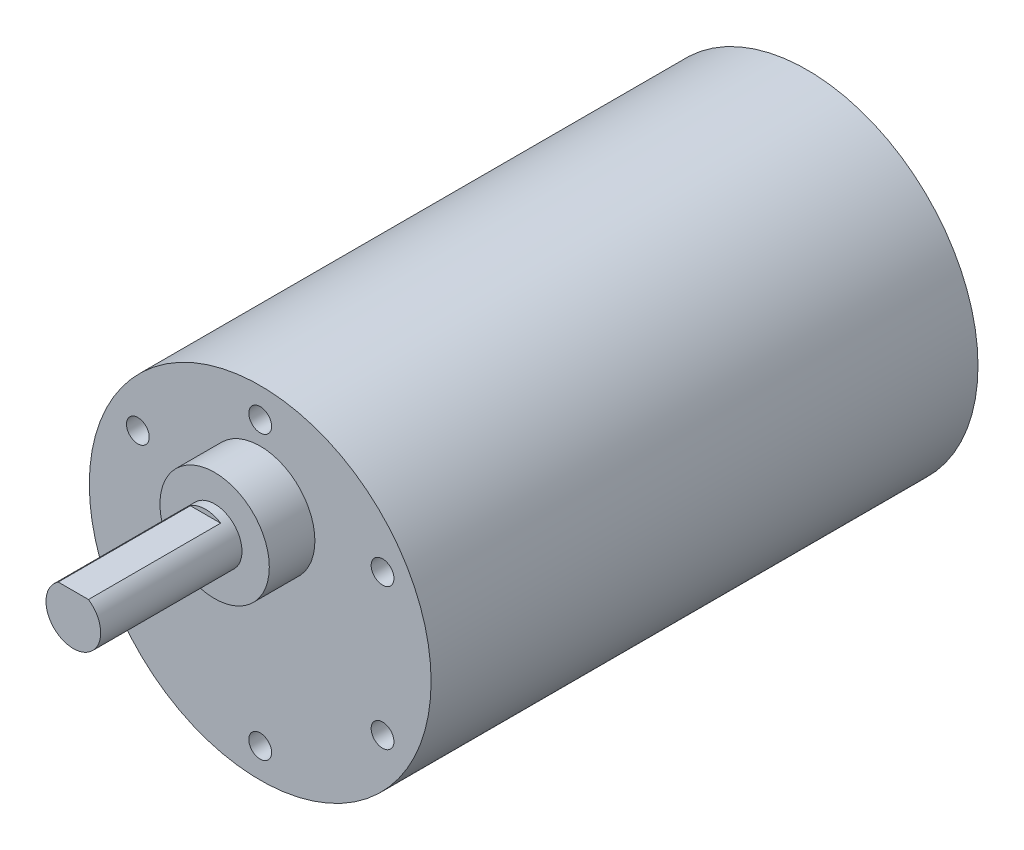
ISO-10303-21;
HEADER;
FILE_DESCRIPTION(('STEP AP214'),'2;1');
FILE_NAME('part.step','',(''),(''),'','','');
FILE_SCHEMA(('AUTOMOTIVE_DESIGN { 1 0 10303 214 1 1 1 1 }'));
ENDSEC;
DATA;
#1=APPLICATION_CONTEXT('core data for automotive mechanical design processes');
#2=APPLICATION_PROTOCOL_DEFINITION('international standard','automotive_design',2000,#1);
#3=PRODUCT_CONTEXT('',#1,'mechanical');
#4=PRODUCT('Part','Part','',(#3));
#5=PRODUCT_RELATED_PRODUCT_CATEGORY('part','',(#4));
#6=PRODUCT_DEFINITION_FORMATION('','',#4);
#7=PRODUCT_DEFINITION_CONTEXT('part definition',#1,'design');
#8=PRODUCT_DEFINITION('design','',#6,#7);
#9=PRODUCT_DEFINITION_SHAPE('','',#8);
#10=(LENGTH_UNIT() NAMED_UNIT(*) SI_UNIT(.MILLI.,.METRE.));
#11=(NAMED_UNIT(*) PLANE_ANGLE_UNIT() SI_UNIT($,.RADIAN.));
#12=(NAMED_UNIT(*) SI_UNIT($,.STERADIAN.) SOLID_ANGLE_UNIT());
#13=UNCERTAINTY_MEASURE_WITH_UNIT(LENGTH_MEASURE(1.E-05),#10,'distance_accuracy_value','');
#14=(GEOMETRIC_REPRESENTATION_CONTEXT(3) GLOBAL_UNCERTAINTY_ASSIGNED_CONTEXT((#13)) GLOBAL_UNIT_ASSIGNED_CONTEXT((#10,
#11,#12)) REPRESENTATION_CONTEXT('',''));
#15=CARTESIAN_POINT('',(0.,0.,0.));
#16=DIRECTION('',(0.,0.,1.));
#17=DIRECTION('',(1.,0.,0.));
#18=AXIS2_PLACEMENT_3D('',#15,#16,#17);
#19=CARTESIAN_POINT('',(0.,0.,60.));
#20=DIRECTION('',(0.,0.,-1.));
#21=DIRECTION('',(-1.,0.,0.));
#22=AXIS2_PLACEMENT_3D('',#19,#20,#21);
#23=CYLINDRICAL_SURFACE('',#22,18.75);
#24=CARTESIAN_POINT('',(0.,0.,60.));
#25=DIRECTION('',(0.,0.,1.));
#26=DIRECTION('',(1.,0.,0.));
#27=AXIS2_PLACEMENT_3D('',#24,#25,#26);
#28=CIRCLE('',#27,18.75);
#29=CARTESIAN_POINT('',(18.75,0.,60.));
#30=VERTEX_POINT('',#29);
#31=EDGE_CURVE('E142',#30,#30,#28,.T.);
#32=ORIENTED_EDGE('',*,*,#31,.F.);
#33=EDGE_LOOP('',(#32));
#34=FACE_BOUND('',#33,.T.);
#35=CARTESIAN_POINT('',(0.,0.,0.));
#36=DIRECTION('',(0.,0.,1.));
#37=DIRECTION('',(1.,0.,0.));
#38=AXIS2_PLACEMENT_3D('',#35,#36,#37);
#39=CIRCLE('',#38,18.75);
#40=CARTESIAN_POINT('',(18.75,0.,0.));
#41=VERTEX_POINT('',#40);
#42=EDGE_CURVE('E146',#41,#41,#39,.T.);
#43=ORIENTED_EDGE('',*,*,#42,.T.);
#44=EDGE_LOOP('',(#43));
#45=FACE_BOUND('',#44,.T.);
#46=ADVANCED_FACE('F43',(#34,#45),#23,.T.);
#47=CARTESIAN_POINT('',(0.,0.,60.));
#48=DIRECTION('',(0.,0.,1.));
#49=DIRECTION('',(1.,0.,0.));
#50=AXIS2_PLACEMENT_3D('',#47,#48,#49);
#51=PLANE('',#50);
#52=CARTESIAN_POINT('',(-13.4233937586587,7.75000000000016,60.));
#53=DIRECTION('',(0.,0.,1.));
#54=DIRECTION('',(1.,0.,0.));
#55=AXIS2_PLACEMENT_3D('',#52,#53,#54);
#56=CIRCLE('',#55,1.24999999999999);
#57=CARTESIAN_POINT('',(-12.1733937586587,7.75000000000016,60.));
#58=VERTEX_POINT('',#57);
#59=EDGE_CURVE('E97',#58,#58,#56,.T.);
#60=ORIENTED_EDGE('',*,*,#59,.F.);
#61=EDGE_LOOP('',(#60));
#62=FACE_BOUND('',#61,.T.);
#63=CARTESIAN_POINT('',(-13.4233937586589,-7.74999999999987,60.));
#64=DIRECTION('',(0.,0.,1.));
#65=DIRECTION('',(1.,0.,0.));
#66=AXIS2_PLACEMENT_3D('',#63,#64,#65);
#67=CIRCLE('',#66,1.24999999999999);
#68=CARTESIAN_POINT('',(-12.1733937586589,-7.74999999999987,60.));
#69=VERTEX_POINT('',#68);
#70=EDGE_CURVE('E96',#69,#69,#67,.T.);
#71=ORIENTED_EDGE('',*,*,#70,.F.);
#72=EDGE_LOOP('',(#71));
#73=FACE_BOUND('',#72,.T.);
#74=CARTESIAN_POINT('',(0.,-15.5,60.));
#75=DIRECTION('',(0.,0.,1.));
#76=DIRECTION('',(1.,0.,0.));
#77=AXIS2_PLACEMENT_3D('',#74,#75,#76);
#78=CIRCLE('',#77,1.24999999999999);
#79=CARTESIAN_POINT('',(1.24999999999999,-15.5,60.));
#80=VERTEX_POINT('',#79);
#81=EDGE_CURVE('E107',#80,#80,#78,.T.);
#82=ORIENTED_EDGE('',*,*,#81,.F.);
#83=EDGE_LOOP('',(#82));
#84=FACE_BOUND('',#83,.T.);
#85=CARTESIAN_POINT('',(13.4233937586588,-7.75000000000006,60.));
#86=DIRECTION('',(0.,0.,1.));
#87=DIRECTION('',(1.,0.,0.));
#88=AXIS2_PLACEMENT_3D('',#85,#86,#87);
#89=CIRCLE('',#88,1.24999999999999);
#90=CARTESIAN_POINT('',(14.6733937586588,-7.75000000000006,60.));
#91=VERTEX_POINT('',#90);
#92=EDGE_CURVE('E113',#91,#91,#89,.T.);
#93=ORIENTED_EDGE('',*,*,#92,.F.);
#94=EDGE_LOOP('',(#93));
#95=FACE_BOUND('',#94,.T.);
#96=CARTESIAN_POINT('',(13.4233937586588,7.74999999999997,60.));
#97=DIRECTION('',(0.,0.,1.));
#98=DIRECTION('',(1.,0.,0.));
#99=AXIS2_PLACEMENT_3D('',#96,#97,#98);
#100=CIRCLE('',#99,1.24999999999999);
#101=CARTESIAN_POINT('',(14.6733937586588,7.74999999999997,60.));
#102=VERTEX_POINT('',#101);
#103=EDGE_CURVE('E119',#102,#102,#100,.T.);
#104=ORIENTED_EDGE('',*,*,#103,.F.);
#105=EDGE_LOOP('',(#104));
#106=FACE_BOUND('',#105,.T.);
#107=CARTESIAN_POINT('',(0.,15.5,60.));
#108=DIRECTION('',(0.,0.,1.));
#109=DIRECTION('',(1.,0.,0.));
#110=AXIS2_PLACEMENT_3D('',#107,#108,#109);
#111=CIRCLE('',#110,1.24999999999999);
#112=CARTESIAN_POINT('',(1.24999999999999,15.5,60.));
#113=VERTEX_POINT('',#112);
#114=EDGE_CURVE('E125',#113,#113,#111,.T.);
#115=ORIENTED_EDGE('',*,*,#114,.F.);
#116=EDGE_LOOP('',(#115));
#117=FACE_BOUND('',#116,.T.);
#118=CARTESIAN_POINT('',(0.,7.,60.));
#119=DIRECTION('',(0.,0.,1.));
#120=DIRECTION('',(1.,0.,0.));
#121=AXIS2_PLACEMENT_3D('',#118,#119,#120);
#122=CIRCLE('',#121,6.);
#123=CARTESIAN_POINT('',(6.,7.,60.));
#124=VERTEX_POINT('',#123);
#125=EDGE_CURVE('E138',#124,#124,#122,.T.);
#126=ORIENTED_EDGE('',*,*,#125,.F.);
#127=EDGE_LOOP('',(#126));
#128=FACE_BOUND('',#127,.T.);
#129=ORIENTED_EDGE('',*,*,#31,.T.);
#130=EDGE_LOOP('',(#129));
#131=FACE_BOUND('',#130,.T.);
#132=ADVANCED_FACE('F173',(#62,#73,#84,#95,#106,#117,#128,#131),#51,.T.);
#133=CARTESIAN_POINT('',(0.,0.,0.));
#134=DIRECTION('',(0.,0.,1.));
#135=DIRECTION('',(1.,0.,0.));
#136=AXIS2_PLACEMENT_3D('',#133,#134,#135);
#137=PLANE('',#136);
#138=ORIENTED_EDGE('',*,*,#42,.F.);
#139=EDGE_LOOP('',(#138));
#140=FACE_BOUND('',#139,.T.);
#141=ADVANCED_FACE('F178',(#140),#137,.F.);
#142=CARTESIAN_POINT('',(0.,7.,65.));
#143=DIRECTION('',(0.,0.,-1.));
#144=DIRECTION('',(-1.,0.,0.));
#145=AXIS2_PLACEMENT_3D('',#142,#143,#144);
#146=CYLINDRICAL_SURFACE('',#145,6.);
#147=CARTESIAN_POINT('',(0.,7.,65.));
#148=DIRECTION('',(0.,0.,1.));
#149=DIRECTION('',(1.,0.,0.));
#150=AXIS2_PLACEMENT_3D('',#147,#148,#149);
#151=CIRCLE('',#150,6.);
#152=CARTESIAN_POINT('',(6.,7.,65.));
#153=VERTEX_POINT('',#152);
#154=EDGE_CURVE('E143',#153,#153,#151,.T.);
#155=ORIENTED_EDGE('',*,*,#154,.F.);
#156=EDGE_LOOP('',(#155));
#157=FACE_BOUND('',#156,.T.);
#158=ORIENTED_EDGE('',*,*,#125,.T.);
#159=EDGE_LOOP('',(#158));
#160=FACE_BOUND('',#159,.T.);
#161=ADVANCED_FACE('F186',(#157,#160),#146,.T.);
#162=CARTESIAN_POINT('',(0.,7.,65.));
#163=DIRECTION('',(0.,0.,1.));
#164=DIRECTION('',(1.,0.,0.));
#165=AXIS2_PLACEMENT_3D('',#162,#163,#164);
#166=PLANE('',#165);
#167=CARTESIAN_POINT('',(0.,7.,65.));
#168=DIRECTION('',(0.,0.,1.));
#169=DIRECTION('',(1.,0.,0.));
#170=AXIS2_PLACEMENT_3D('',#167,#168,#169);
#171=CIRCLE('',#170,3.);
#172=CARTESIAN_POINT('',(3.,7.,65.));
#173=VERTEX_POINT('',#172);
#174=EDGE_CURVE('E139',#173,#173,#171,.T.);
#175=ORIENTED_EDGE('',*,*,#174,.F.);
#176=EDGE_LOOP('',(#175));
#177=FACE_BOUND('',#176,.T.);
#178=ORIENTED_EDGE('',*,*,#154,.T.);
#179=EDGE_LOOP('',(#178));
#180=FACE_BOUND('',#179,.T.);
#181=ADVANCED_FACE('F169',(#177,#180),#166,.T.);
#182=CARTESIAN_POINT('',(0.,7.,80.5));
#183=DIRECTION('',(0.,0.,-1.));
#184=DIRECTION('',(-1.,0.,0.));
#185=AXIS2_PLACEMENT_3D('',#182,#183,#184);
#186=CYLINDRICAL_SURFACE('',#185,3.);
#187=CARTESIAN_POINT('',(0.,7.,80.5));
#188=DIRECTION('',(0.,0.,1.));
#189=DIRECTION('',(1.,0.,0.));
#190=AXIS2_PLACEMENT_3D('',#187,#188,#189);
#191=CIRCLE('',#190,3.);
#192=CARTESIAN_POINT('',(-1.6583123951777,9.5,80.5));
#193=VERTEX_POINT('',#192);
#194=CARTESIAN_POINT('',(1.6583123951777,9.5,80.5));
#195=VERTEX_POINT('',#194);
#196=EDGE_CURVE('E135',#193,#195,#191,.T.);
#197=ORIENTED_EDGE('',*,*,#196,.F.);
#198=DIRECTION('',(0.,0.,-1.));
#199=VECTOR('',#198,1.);
#200=CARTESIAN_POINT('',(-1.6583123951777,9.5,80.5));
#201=LINE('',#200,#199);
#202=CARTESIAN_POINT('',(-1.6583123951777,9.5,66.));
#203=VERTEX_POINT('',#202);
#204=EDGE_CURVE('E57',#193,#203,#201,.T.);
#205=ORIENTED_EDGE('',*,*,#204,.T.);
#206=CARTESIAN_POINT('',(0.,7.,66.));
#207=DIRECTION('',(0.,0.,1.));
#208=DIRECTION('',(1.,0.,0.));
#209=AXIS2_PLACEMENT_3D('',#206,#207,#208);
#210=CIRCLE('',#209,3.);
#211=CARTESIAN_POINT('',(1.6583123951777,9.5,66.));
#212=VERTEX_POINT('',#211);
#213=EDGE_CURVE('E11',#212,#203,#210,.T.);
#214=ORIENTED_EDGE('',*,*,#213,.F.);
#215=DIRECTION('',(0.,0.,-1.));
#216=VECTOR('',#215,1.);
#217=CARTESIAN_POINT('',(1.6583123951777,9.5,80.5));
#218=LINE('',#217,#216);
#219=EDGE_CURVE('E62',#212,#195,#218,.F.);
#220=ORIENTED_EDGE('',*,*,#219,.T.);
#221=EDGE_LOOP('',(#197,#205,#214,#220));
#222=FACE_BOUND('',#221,.T.);
#223=ORIENTED_EDGE('',*,*,#174,.T.);
#224=EDGE_LOOP('',(#223));
#225=FACE_BOUND('',#224,.T.);
#226=ADVANCED_FACE('F157',(#222,#225),#186,.T.);
#227=CARTESIAN_POINT('',(0.,7.,80.5));
#228=DIRECTION('',(0.,0.,1.));
#229=DIRECTION('',(1.,0.,0.));
#230=AXIS2_PLACEMENT_3D('',#227,#228,#229);
#231=PLANE('',#230);
#232=DIRECTION('',(1.,0.,0.));
#233=VECTOR('',#232,1.);
#234=CARTESIAN_POINT('',(0.,9.5,80.5));
#235=LINE('',#234,#233);
#236=EDGE_CURVE('E50',#193,#195,#235,.T.);
#237=ORIENTED_EDGE('',*,*,#236,.F.);
#238=ORIENTED_EDGE('',*,*,#196,.T.);
#239=EDGE_LOOP('',(#237,#238));
#240=FACE_BOUND('',#239,.T.);
#241=ADVANCED_FACE('F159',(#240),#231,.T.);
#242=CARTESIAN_POINT('',(0.,0.,66.));
#243=DIRECTION('',(0.,0.,1.));
#244=DIRECTION('',(1.,0.,0.));
#245=AXIS2_PLACEMENT_3D('',#242,#243,#244);
#246=PLANE('',#245);
#247=ORIENTED_EDGE('',*,*,#213,.T.);
#248=DIRECTION('',(1.,0.,0.));
#249=VECTOR('',#248,1.);
#250=CARTESIAN_POINT('',(-3.70795386806472,9.5,66.));
#251=LINE('',#250,#249);
#252=EDGE_CURVE('E131',#203,#212,#251,.T.);
#253=ORIENTED_EDGE('',*,*,#252,.T.);
#254=EDGE_LOOP('',(#247,#253));
#255=FACE_BOUND('',#254,.T.);
#256=ADVANCED_FACE('F161',(#255),#246,.T.);
#257=CARTESIAN_POINT('',(-3.70795386806472,9.5,66.));
#258=DIRECTION('',(0.,-1.,0.));
#259=DIRECTION('',(0.,0.,-1.));
#260=AXIS2_PLACEMENT_3D('',#257,#258,#259);
#261=PLANE('',#260);
#262=ORIENTED_EDGE('',*,*,#236,.T.);
#263=ORIENTED_EDGE('',*,*,#219,.F.);
#264=ORIENTED_EDGE('',*,*,#252,.F.);
#265=ORIENTED_EDGE('',*,*,#204,.F.);
#266=EDGE_LOOP('',(#262,#263,#264,#265));
#267=FACE_BOUND('',#266,.T.);
#268=ADVANCED_FACE('F152',(#267),#261,.F.);
#269=CARTESIAN_POINT('',(0.,15.5,52.5));
#270=DIRECTION('',(0.,0.,1.));
#271=DIRECTION('',(1.,0.,0.));
#272=AXIS2_PLACEMENT_3D('',#269,#270,#271);
#273=CONICAL_SURFACE('',#272,1.24999999999999,1.02974425867665);
#274=CARTESIAN_POINT('',(0.,15.5,51.7489242262155));
#275=VERTEX_POINT('',#274);
#276=VERTEX_LOOP('',#275);
#277=FACE_BOUND('',#276,.T.);
#278=CARTESIAN_POINT('',(0.,15.5,52.5));
#279=DIRECTION('',(0.,0.,1.));
#280=DIRECTION('',(1.,0.,0.));
#281=AXIS2_PLACEMENT_3D('',#278,#279,#280);
#282=CIRCLE('',#281,1.24999999999999);
#283=CARTESIAN_POINT('',(1.24999999999999,15.5,52.5));
#284=VERTEX_POINT('',#283);
#285=EDGE_CURVE('E128',#284,#284,#282,.T.);
#286=ORIENTED_EDGE('',*,*,#285,.T.);
#287=EDGE_LOOP('',(#286));
#288=FACE_BOUND('',#287,.T.);
#289=ADVANCED_FACE('F229',(#277,#288),#273,.F.);
#290=CARTESIAN_POINT('',(0.,15.5,60.));
#291=DIRECTION('',(0.,0.,1.));
#292=DIRECTION('',(1.,0.,0.));
#293=AXIS2_PLACEMENT_3D('',#290,#291,#292);
#294=CYLINDRICAL_SURFACE('',#293,1.24999999999999);
#295=ORIENTED_EDGE('',*,*,#285,.F.);
#296=EDGE_LOOP('',(#295));
#297=FACE_BOUND('',#296,.T.);
#298=ORIENTED_EDGE('',*,*,#114,.T.);
#299=EDGE_LOOP('',(#298));
#300=FACE_BOUND('',#299,.T.);
#301=ADVANCED_FACE('F237',(#297,#300),#294,.F.);
#302=CARTESIAN_POINT('',(13.4233937586588,7.74999999999997,52.5));
#303=DIRECTION('',(0.,0.,1.));
#304=DIRECTION('',(1.,0.,0.));
#305=AXIS2_PLACEMENT_3D('',#302,#303,#304);
#306=CONICAL_SURFACE('',#305,1.24999999999999,1.02974425867665);
#307=CARTESIAN_POINT('',(13.4233937586588,7.74999999999997,51.7489242262155));
#308=VERTEX_POINT('',#307);
#309=VERTEX_LOOP('',#308);
#310=FACE_BOUND('',#309,.T.);
#311=CARTESIAN_POINT('',(13.4233937586588,7.74999999999997,52.5));
#312=DIRECTION('',(0.,0.,1.));
#313=DIRECTION('',(1.,0.,0.));
#314=AXIS2_PLACEMENT_3D('',#311,#312,#313);
#315=CIRCLE('',#314,1.24999999999999);
#316=CARTESIAN_POINT('',(14.6733937586588,7.74999999999997,52.5));
#317=VERTEX_POINT('',#316);
#318=EDGE_CURVE('E122',#317,#317,#315,.T.);
#319=ORIENTED_EDGE('',*,*,#318,.T.);
#320=EDGE_LOOP('',(#319));
#321=FACE_BOUND('',#320,.T.);
#322=ADVANCED_FACE('F248',(#310,#321),#306,.F.);
#323=CARTESIAN_POINT('',(13.4233937586588,7.74999999999997,60.));
#324=DIRECTION('',(0.,0.,1.));
#325=DIRECTION('',(1.,0.,0.));
#326=AXIS2_PLACEMENT_3D('',#323,#324,#325);
#327=CYLINDRICAL_SURFACE('',#326,1.24999999999999);
#328=ORIENTED_EDGE('',*,*,#318,.F.);
#329=EDGE_LOOP('',(#328));
#330=FACE_BOUND('',#329,.T.);
#331=ORIENTED_EDGE('',*,*,#103,.T.);
#332=EDGE_LOOP('',(#331));
#333=FACE_BOUND('',#332,.T.);
#334=ADVANCED_FACE('F268',(#330,#333),#327,.F.);
#335=CARTESIAN_POINT('',(13.4233937586588,-7.75000000000006,52.5));
#336=DIRECTION('',(0.,0.,1.));
#337=DIRECTION('',(1.,0.,0.));
#338=AXIS2_PLACEMENT_3D('',#335,#336,#337);
#339=CONICAL_SURFACE('',#338,1.24999999999999,1.02974425867665);
#340=CARTESIAN_POINT('',(13.4233937586588,-7.75000000000006,51.7489242262155));
#341=VERTEX_POINT('',#340);
#342=VERTEX_LOOP('',#341);
#343=FACE_BOUND('',#342,.T.);
#344=CARTESIAN_POINT('',(13.4233937586588,-7.75000000000006,52.5));
#345=DIRECTION('',(0.,0.,1.));
#346=DIRECTION('',(1.,0.,0.));
#347=AXIS2_PLACEMENT_3D('',#344,#345,#346);
#348=CIRCLE('',#347,1.24999999999999);
#349=CARTESIAN_POINT('',(14.6733937586588,-7.75000000000006,52.5));
#350=VERTEX_POINT('',#349);
#351=EDGE_CURVE('E116',#350,#350,#348,.T.);
#352=ORIENTED_EDGE('',*,*,#351,.T.);
#353=EDGE_LOOP('',(#352));
#354=FACE_BOUND('',#353,.T.);
#355=ADVANCED_FACE('F279',(#343,#354),#339,.F.);
#356=CARTESIAN_POINT('',(13.4233937586588,-7.75000000000006,60.));
#357=DIRECTION('',(0.,0.,1.));
#358=DIRECTION('',(1.,0.,0.));
#359=AXIS2_PLACEMENT_3D('',#356,#357,#358);
#360=CYLINDRICAL_SURFACE('',#359,1.24999999999999);
#361=ORIENTED_EDGE('',*,*,#351,.F.);
#362=EDGE_LOOP('',(#361));
#363=FACE_BOUND('',#362,.T.);
#364=ORIENTED_EDGE('',*,*,#92,.T.);
#365=EDGE_LOOP('',(#364));
#366=FACE_BOUND('',#365,.T.);
#367=ADVANCED_FACE('F292',(#363,#366),#360,.F.);
#368=CARTESIAN_POINT('',(0.,-15.5,52.5));
#369=DIRECTION('',(0.,0.,1.));
#370=DIRECTION('',(1.,0.,0.));
#371=AXIS2_PLACEMENT_3D('',#368,#369,#370);
#372=CONICAL_SURFACE('',#371,1.24999999999999,1.02974425867665);
#373=CARTESIAN_POINT('',(0.,-15.5,51.7489242262155));
#374=VERTEX_POINT('',#373);
#375=VERTEX_LOOP('',#374);
#376=FACE_BOUND('',#375,.T.);
#377=CARTESIAN_POINT('',(0.,-15.5,52.5));
#378=DIRECTION('',(0.,0.,1.));
#379=DIRECTION('',(1.,0.,0.));
#380=AXIS2_PLACEMENT_3D('',#377,#378,#379);
#381=CIRCLE('',#380,1.24999999999999);
#382=CARTESIAN_POINT('',(1.24999999999999,-15.5,52.5));
#383=VERTEX_POINT('',#382);
#384=EDGE_CURVE('E110',#383,#383,#381,.T.);
#385=ORIENTED_EDGE('',*,*,#384,.T.);
#386=EDGE_LOOP('',(#385));
#387=FACE_BOUND('',#386,.T.);
#388=ADVANCED_FACE('F302',(#376,#387),#372,.F.);
#389=CARTESIAN_POINT('',(0.,-15.5,60.));
#390=DIRECTION('',(0.,0.,1.));
#391=DIRECTION('',(1.,0.,0.));
#392=AXIS2_PLACEMENT_3D('',#389,#390,#391);
#393=CYLINDRICAL_SURFACE('',#392,1.24999999999999);
#394=ORIENTED_EDGE('',*,*,#384,.F.);
#395=EDGE_LOOP('',(#394));
#396=FACE_BOUND('',#395,.T.);
#397=ORIENTED_EDGE('',*,*,#81,.T.);
#398=EDGE_LOOP('',(#397));
#399=FACE_BOUND('',#398,.T.);
#400=ADVANCED_FACE('F314',(#396,#399),#393,.F.);
#401=CARTESIAN_POINT('',(-13.4233937586589,-7.74999999999987,52.5));
#402=DIRECTION('',(0.,0.,1.));
#403=DIRECTION('',(1.,0.,0.));
#404=AXIS2_PLACEMENT_3D('',#401,#402,#403);
#405=CONICAL_SURFACE('',#404,1.24999999999999,1.02974425867665);
#406=CARTESIAN_POINT('',(-13.4233937586589,-7.74999999999987,51.7489242262155));
#407=VERTEX_POINT('',#406);
#408=VERTEX_LOOP('',#407);
#409=FACE_BOUND('',#408,.T.);
#410=CARTESIAN_POINT('',(-13.4233937586589,-7.74999999999987,52.5));
#411=DIRECTION('',(0.,0.,1.));
#412=DIRECTION('',(1.,0.,0.));
#413=AXIS2_PLACEMENT_3D('',#410,#411,#412);
#414=CIRCLE('',#413,1.24999999999999);
#415=CARTESIAN_POINT('',(-12.1733937586589,-7.74999999999987,52.5));
#416=VERTEX_POINT('',#415);
#417=EDGE_CURVE('E100',#416,#416,#414,.T.);
#418=ORIENTED_EDGE('',*,*,#417,.T.);
#419=EDGE_LOOP('',(#418));
#420=FACE_BOUND('',#419,.T.);
#421=ADVANCED_FACE('F324',(#409,#420),#405,.F.);
#422=CARTESIAN_POINT('',(-13.4233937586589,-7.74999999999987,60.));
#423=DIRECTION('',(0.,0.,1.));
#424=DIRECTION('',(1.,0.,0.));
#425=AXIS2_PLACEMENT_3D('',#422,#423,#424);
#426=CYLINDRICAL_SURFACE('',#425,1.24999999999999);
#427=ORIENTED_EDGE('',*,*,#417,.F.);
#428=EDGE_LOOP('',(#427));
#429=FACE_BOUND('',#428,.T.);
#430=ORIENTED_EDGE('',*,*,#70,.T.);
#431=EDGE_LOOP('',(#430));
#432=FACE_BOUND('',#431,.T.);
#433=ADVANCED_FACE('F90',(#429,#432),#426,.F.);
#434=CARTESIAN_POINT('',(-13.4233937586587,7.75000000000016,52.5));
#435=DIRECTION('',(0.,0.,1.));
#436=DIRECTION('',(1.,0.,0.));
#437=AXIS2_PLACEMENT_3D('',#434,#435,#436);
#438=CONICAL_SURFACE('',#437,1.24999999999999,1.02974425867665);
#439=CARTESIAN_POINT('',(-13.4233937586587,7.75000000000016,51.7489242262155));
#440=VERTEX_POINT('',#439);
#441=VERTEX_LOOP('',#440);
#442=FACE_BOUND('',#441,.T.);
#443=CARTESIAN_POINT('',(-13.4233937586587,7.75000000000016,52.5));
#444=DIRECTION('',(0.,0.,1.));
#445=DIRECTION('',(1.,0.,0.));
#446=AXIS2_PLACEMENT_3D('',#443,#444,#445);
#447=CIRCLE('',#446,1.24999999999999);
#448=CARTESIAN_POINT('',(-12.1733937586587,7.75000000000016,52.5));
#449=VERTEX_POINT('',#448);
#450=EDGE_CURVE('E94',#449,#449,#447,.T.);
#451=ORIENTED_EDGE('',*,*,#450,.T.);
#452=EDGE_LOOP('',(#451));
#453=FACE_BOUND('',#452,.T.);
#454=ADVANCED_FACE('F86',(#442,#453),#438,.F.);
#455=CARTESIAN_POINT('',(-13.4233937586587,7.75000000000016,60.));
#456=DIRECTION('',(0.,0.,1.));
#457=DIRECTION('',(1.,0.,0.));
#458=AXIS2_PLACEMENT_3D('',#455,#456,#457);
#459=CYLINDRICAL_SURFACE('',#458,1.24999999999999);
#460=ORIENTED_EDGE('',*,*,#450,.F.);
#461=EDGE_LOOP('',(#460));
#462=FACE_BOUND('',#461,.T.);
#463=ORIENTED_EDGE('',*,*,#59,.T.);
#464=EDGE_LOOP('',(#463));
#465=FACE_BOUND('',#464,.T.);
#466=ADVANCED_FACE('F89',(#462,#465),#459,.F.);
#467=CLOSED_SHELL('',(#46,#132,#141,#161,#181,#226,#241,#256,#268,#289,#301,#322,#334,#355,#367,
#388,#400,#421,#433,#454,#466));
#468=MANIFOLD_SOLID_BREP('B2',#467);
#469=ADVANCED_BREP_SHAPE_REPRESENTATION('',(#18,#468),#14);
#470=SHAPE_DEFINITION_REPRESENTATION(#9,#469);
ENDSEC;
END-ISO-10303-21;
